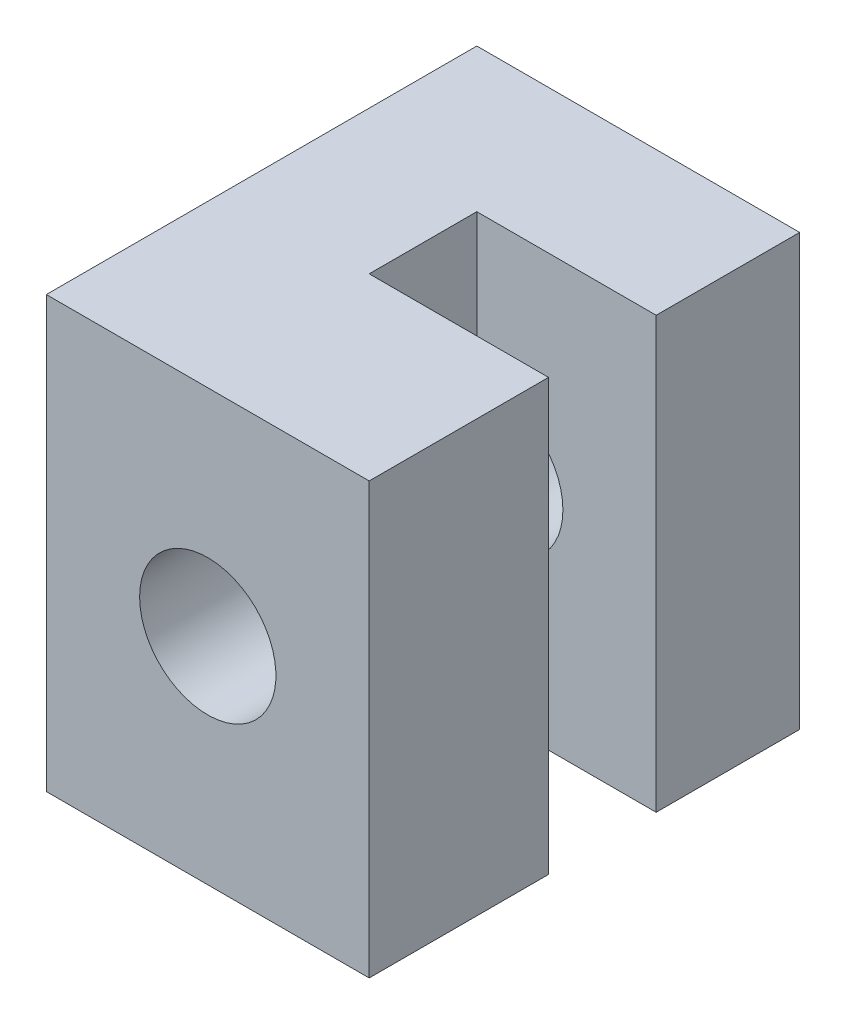
ISO-10303-21;
HEADER;
FILE_DESCRIPTION(('STEP AP214'),'2;1');
FILE_NAME('part.step','',(''),(''),'','','');
FILE_SCHEMA(('AUTOMOTIVE_DESIGN { 1 0 10303 214 1 1 1 1 }'));
ENDSEC;
DATA;
#1=APPLICATION_CONTEXT('core data for automotive mechanical design processes');
#2=APPLICATION_PROTOCOL_DEFINITION('international standard','automotive_design',2000,#1);
#3=PRODUCT_CONTEXT('',#1,'mechanical');
#4=PRODUCT('Part','Part','',(#3));
#5=PRODUCT_RELATED_PRODUCT_CATEGORY('part','',(#4));
#6=PRODUCT_DEFINITION_FORMATION('','',#4);
#7=PRODUCT_DEFINITION_CONTEXT('part definition',#1,'design');
#8=PRODUCT_DEFINITION('design','',#6,#7);
#9=PRODUCT_DEFINITION_SHAPE('','',#8);
#10=(LENGTH_UNIT() NAMED_UNIT(*) SI_UNIT(.MILLI.,.METRE.));
#11=(NAMED_UNIT(*) PLANE_ANGLE_UNIT() SI_UNIT($,.RADIAN.));
#12=(NAMED_UNIT(*) SI_UNIT($,.STERADIAN.) SOLID_ANGLE_UNIT());
#13=UNCERTAINTY_MEASURE_WITH_UNIT(LENGTH_MEASURE(1.E-05),#10,'distance_accuracy_value','');
#14=(GEOMETRIC_REPRESENTATION_CONTEXT(3) GLOBAL_UNCERTAINTY_ASSIGNED_CONTEXT((#13)) GLOBAL_UNIT_ASSIGNED_CONTEXT((#10,
#11,#12)) REPRESENTATION_CONTEXT('',''));
#15=CARTESIAN_POINT('',(0.,0.,0.));
#16=DIRECTION('',(0.,0.,1.));
#17=DIRECTION('',(1.,0.,0.));
#18=AXIS2_PLACEMENT_3D('',#15,#16,#17);
#19=CARTESIAN_POINT('',(-0.500000000000002,6.,0.));
#20=DIRECTION('',(-1.,0.,0.));
#21=DIRECTION('',(0.,0.,1.));
#22=AXIS2_PLACEMENT_3D('',#19,#20,#21);
#23=PLANE('',#22);
#24=DIRECTION('',(0.,-1.,0.));
#25=VECTOR('',#24,1.);
#26=CARTESIAN_POINT('',(-0.500000000000002,6.,1.));
#27=LINE('',#26,#25);
#28=CARTESIAN_POINT('',(-0.500000000000002,6.,1.));
#29=VERTEX_POINT('',#28);
#30=CARTESIAN_POINT('',(-0.500000000000002,1.83303027798233,1.));
#31=VERTEX_POINT('',#30);
#32=EDGE_CURVE('E170',#29,#31,#27,.T.);
#33=ORIENTED_EDGE('',*,*,#32,.T.);
#34=DIRECTION('',(0.,0.,-1.));
#35=VECTOR('',#34,1.);
#36=CARTESIAN_POINT('',(-0.500000000000002,1.83303027798233,6.));
#37=LINE('',#36,#35);
#38=CARTESIAN_POINT('',(-0.500000000000002,1.83303027798233,-2.));
#39=VERTEX_POINT('',#38);
#40=EDGE_CURVE('E56',#31,#39,#37,.T.);
#41=ORIENTED_EDGE('',*,*,#40,.T.);
#42=DIRECTION('',(0.,-1.,0.));
#43=VECTOR('',#42,1.);
#44=CARTESIAN_POINT('',(-0.500000000000002,6.,-2.));
#45=LINE('',#44,#43);
#46=CARTESIAN_POINT('',(-0.500000000000002,6.,-2.));
#47=VERTEX_POINT('',#46);
#48=EDGE_CURVE('E49',#47,#39,#45,.T.);
#49=ORIENTED_EDGE('',*,*,#48,.F.);
#50=DIRECTION('',(0.,0.,-1.));
#51=VECTOR('',#50,1.);
#52=CARTESIAN_POINT('',(-0.500000000000002,6.,0.));
#53=LINE('',#52,#51);
#54=EDGE_CURVE('E169',#29,#47,#53,.T.);
#55=ORIENTED_EDGE('',*,*,#54,.F.);
#56=EDGE_LOOP('',(#33,#41,#49,#55));
#57=FACE_BOUND('',#56,.T.);
#58=ADVANCED_FACE('F41',(#57),#23,.F.);
#59=CARTESIAN_POINT('',(-0.500000000000002,-1.83303027798234,-2.));
#60=VERTEX_POINT('',#59);
#61=CARTESIAN_POINT('',(-0.500000000000002,-6.,-2.));
#62=VERTEX_POINT('',#61);
#63=EDGE_CURVE('E181',#60,#62,#45,.T.);
#64=ORIENTED_EDGE('',*,*,#63,.F.);
#65=DIRECTION('',(0.,0.,-1.));
#66=VECTOR('',#65,1.);
#67=CARTESIAN_POINT('',(-0.500000000000002,-1.83303027798234,6.));
#68=LINE('',#67,#66);
#69=CARTESIAN_POINT('',(-0.500000000000002,-1.83303027798234,1.));
#70=VERTEX_POINT('',#69);
#71=EDGE_CURVE('E208',#60,#70,#68,.F.);
#72=ORIENTED_EDGE('',*,*,#71,.T.);
#73=CARTESIAN_POINT('',(-0.500000000000002,-6.,1.));
#74=VERTEX_POINT('',#73);
#75=EDGE_CURVE('E98',#70,#74,#27,.T.);
#76=ORIENTED_EDGE('',*,*,#75,.T.);
#77=DIRECTION('',(0.,0.,-1.));
#78=VECTOR('',#77,1.);
#79=CARTESIAN_POINT('',(-0.500000000000002,-6.,0.));
#80=LINE('',#79,#78);
#81=EDGE_CURVE('E150',#74,#62,#80,.T.);
#82=ORIENTED_EDGE('',*,*,#81,.T.);
#83=EDGE_LOOP('',(#64,#72,#76,#82));
#84=FACE_BOUND('',#83,.T.);
#85=ADVANCED_FACE('F43',(#84),#23,.F.);
#86=CARTESIAN_POINT('',(0.,6.,-2.));
#87=DIRECTION('',(0.,0.,-1.));
#88=DIRECTION('',(-1.,0.,0.));
#89=AXIS2_PLACEMENT_3D('',#86,#87,#88);
#90=PLANE('',#89);
#91=ORIENTED_EDGE('',*,*,#48,.T.);
#92=CARTESIAN_POINT('',(0.,0.,-2.));
#93=DIRECTION('',(0.,0.,-1.));
#94=DIRECTION('',(-1.,0.,0.));
#95=AXIS2_PLACEMENT_3D('',#92,#93,#94);
#96=CIRCLE('',#95,1.9);
#97=EDGE_CURVE('E153',#39,#60,#96,.T.);
#98=ORIENTED_EDGE('',*,*,#97,.T.);
#99=ORIENTED_EDGE('',*,*,#63,.T.);
#100=DIRECTION('',(1.,0.,0.));
#101=VECTOR('',#100,1.);
#102=CARTESIAN_POINT('',(0.,-6.,-2.));
#103=LINE('',#102,#101);
#104=CARTESIAN_POINT('',(4.5,-6.,-2.));
#105=VERTEX_POINT('',#104);
#106=EDGE_CURVE('E152',#62,#105,#103,.T.);
#107=ORIENTED_EDGE('',*,*,#106,.T.);
#108=DIRECTION('',(0.,-1.,0.));
#109=VECTOR('',#108,1.);
#110=CARTESIAN_POINT('',(4.5,6.,-2.));
#111=LINE('',#110,#109);
#112=CARTESIAN_POINT('',(4.5,6.,-2.));
#113=VERTEX_POINT('',#112);
#114=EDGE_CURVE('E179',#113,#105,#111,.T.);
#115=ORIENTED_EDGE('',*,*,#114,.F.);
#116=DIRECTION('',(1.,0.,0.));
#117=VECTOR('',#116,1.);
#118=CARTESIAN_POINT('',(0.,6.,-2.));
#119=LINE('',#118,#117);
#120=EDGE_CURVE('E107',#47,#113,#119,.T.);
#121=ORIENTED_EDGE('',*,*,#120,.F.);
#122=EDGE_LOOP('',(#91,#98,#99,#107,#115,#121));
#123=FACE_BOUND('',#122,.T.);
#124=ADVANCED_FACE('F186',(#123),#90,.F.);
#125=CARTESIAN_POINT('',(4.5,6.,0.));
#126=DIRECTION('',(-1.,0.,0.));
#127=DIRECTION('',(0.,0.,1.));
#128=AXIS2_PLACEMENT_3D('',#125,#126,#127);
#129=PLANE('',#128);
#130=DIRECTION('',(0.,0.,-1.));
#131=VECTOR('',#130,1.);
#132=CARTESIAN_POINT('',(4.5,-6.,0.));
#133=LINE('',#132,#131);
#134=CARTESIAN_POINT('',(4.5,-6.,-6.));
#135=VERTEX_POINT('',#134);
#136=EDGE_CURVE('E155',#105,#135,#133,.T.);
#137=ORIENTED_EDGE('',*,*,#136,.T.);
#138=DIRECTION('',(0.,-1.,0.));
#139=VECTOR('',#138,1.);
#140=CARTESIAN_POINT('',(4.5,6.,-6.));
#141=LINE('',#140,#139);
#142=CARTESIAN_POINT('',(4.5,6.,-6.));
#143=VERTEX_POINT('',#142);
#144=EDGE_CURVE('E177',#143,#135,#141,.T.);
#145=ORIENTED_EDGE('',*,*,#144,.F.);
#146=DIRECTION('',(0.,0.,-1.));
#147=VECTOR('',#146,1.);
#148=CARTESIAN_POINT('',(4.5,6.,0.));
#149=LINE('',#148,#147);
#150=EDGE_CURVE('E221',#113,#143,#149,.T.);
#151=ORIENTED_EDGE('',*,*,#150,.F.);
#152=ORIENTED_EDGE('',*,*,#114,.T.);
#153=EDGE_LOOP('',(#137,#145,#151,#152));
#154=FACE_BOUND('',#153,.T.);
#155=ADVANCED_FACE('F198',(#154),#129,.F.);
#156=CARTESIAN_POINT('',(0.,6.,-6.));
#157=DIRECTION('',(0.,0.,-1.));
#158=DIRECTION('',(-1.,0.,0.));
#159=AXIS2_PLACEMENT_3D('',#156,#157,#158);
#160=PLANE('',#159);
#161=CARTESIAN_POINT('',(0.,0.,-6.));
#162=DIRECTION('',(0.,0.,-1.));
#163=DIRECTION('',(-1.,0.,0.));
#164=AXIS2_PLACEMENT_3D('',#161,#162,#163);
#165=CIRCLE('',#164,1.9);
#166=CARTESIAN_POINT('',(-1.9,0.,-6.));
#167=VERTEX_POINT('',#166);
#168=EDGE_CURVE('E214',#167,#167,#165,.T.);
#169=ORIENTED_EDGE('',*,*,#168,.F.);
#170=EDGE_LOOP('',(#169));
#171=FACE_BOUND('',#170,.T.);
#172=DIRECTION('',(1.,0.,0.));
#173=VECTOR('',#172,1.);
#174=CARTESIAN_POINT('',(0.,-6.,-6.));
#175=LINE('',#174,#173);
#176=CARTESIAN_POINT('',(-4.5,-6.,-6.));
#177=VERTEX_POINT('',#176);
#178=EDGE_CURVE('E158',#177,#135,#175,.T.);
#179=ORIENTED_EDGE('',*,*,#178,.F.);
#180=DIRECTION('',(0.,-1.,0.));
#181=VECTOR('',#180,1.);
#182=CARTESIAN_POINT('',(-4.5,6.,-6.));
#183=LINE('',#182,#181);
#184=CARTESIAN_POINT('',(-4.5,6.,-6.));
#185=VERTEX_POINT('',#184);
#186=EDGE_CURVE('E175',#185,#177,#183,.T.);
#187=ORIENTED_EDGE('',*,*,#186,.F.);
#188=DIRECTION('',(1.,0.,0.));
#189=VECTOR('',#188,1.);
#190=CARTESIAN_POINT('',(0.,6.,-6.));
#191=LINE('',#190,#189);
#192=EDGE_CURVE('E223',#185,#143,#191,.T.);
#193=ORIENTED_EDGE('',*,*,#192,.T.);
#194=ORIENTED_EDGE('',*,*,#144,.T.);
#195=EDGE_LOOP('',(#179,#187,#193,#194));
#196=FACE_BOUND('',#195,.T.);
#197=ADVANCED_FACE('F230',(#171,#196),#160,.T.);
#198=CARTESIAN_POINT('',(-4.5,6.,0.));
#199=DIRECTION('',(-1.,0.,0.));
#200=DIRECTION('',(0.,0.,1.));
#201=AXIS2_PLACEMENT_3D('',#198,#199,#200);
#202=PLANE('',#201);
#203=DIRECTION('',(0.,0.,-1.));
#204=VECTOR('',#203,1.);
#205=CARTESIAN_POINT('',(-4.5,-6.,0.));
#206=LINE('',#205,#204);
#207=CARTESIAN_POINT('',(-4.5,-6.,6.));
#208=VERTEX_POINT('',#207);
#209=EDGE_CURVE('E161',#208,#177,#206,.T.);
#210=ORIENTED_EDGE('',*,*,#209,.F.);
#211=DIRECTION('',(0.,-1.,0.));
#212=VECTOR('',#211,1.);
#213=CARTESIAN_POINT('',(-4.5,6.,6.));
#214=LINE('',#213,#212);
#215=CARTESIAN_POINT('',(-4.5,6.,6.));
#216=VERTEX_POINT('',#215);
#217=EDGE_CURVE('E141',#216,#208,#214,.T.);
#218=ORIENTED_EDGE('',*,*,#217,.F.);
#219=DIRECTION('',(0.,0.,-1.));
#220=VECTOR('',#219,1.);
#221=CARTESIAN_POINT('',(-4.5,6.,0.));
#222=LINE('',#221,#220);
#223=EDGE_CURVE('E131',#216,#185,#222,.T.);
#224=ORIENTED_EDGE('',*,*,#223,.T.);
#225=ORIENTED_EDGE('',*,*,#186,.T.);
#226=EDGE_LOOP('',(#210,#218,#224,#225));
#227=FACE_BOUND('',#226,.T.);
#228=ADVANCED_FACE('F227',(#227),#202,.T.);
#229=CARTESIAN_POINT('',(0.,6.,6.));
#230=DIRECTION('',(0.,0.,-1.));
#231=DIRECTION('',(-1.,0.,0.));
#232=AXIS2_PLACEMENT_3D('',#229,#230,#231);
#233=PLANE('',#232);
#234=CARTESIAN_POINT('',(0.,0.,6.));
#235=DIRECTION('',(0.,0.,-1.));
#236=DIRECTION('',(-1.,0.,0.));
#237=AXIS2_PLACEMENT_3D('',#234,#235,#236);
#238=CIRCLE('',#237,1.9);
#239=CARTESIAN_POINT('',(-1.9,0.,6.));
#240=VERTEX_POINT('',#239);
#241=EDGE_CURVE('E210',#240,#240,#238,.T.);
#242=ORIENTED_EDGE('',*,*,#241,.T.);
#243=EDGE_LOOP('',(#242));
#244=FACE_BOUND('',#243,.T.);
#245=DIRECTION('',(1.,0.,0.));
#246=VECTOR('',#245,1.);
#247=CARTESIAN_POINT('',(0.,-6.,6.));
#248=LINE('',#247,#246);
#249=CARTESIAN_POINT('',(4.5,-6.,6.));
#250=VERTEX_POINT('',#249);
#251=EDGE_CURVE('E138',#208,#250,#248,.T.);
#252=ORIENTED_EDGE('',*,*,#251,.T.);
#253=DIRECTION('',(0.,-1.,0.));
#254=VECTOR('',#253,1.);
#255=CARTESIAN_POINT('',(4.5,6.,6.));
#256=LINE('',#255,#254);
#257=CARTESIAN_POINT('',(4.5,6.,6.));
#258=VERTEX_POINT('',#257);
#259=EDGE_CURVE('E135',#258,#250,#256,.T.);
#260=ORIENTED_EDGE('',*,*,#259,.F.);
#261=DIRECTION('',(1.,0.,0.));
#262=VECTOR('',#261,1.);
#263=CARTESIAN_POINT('',(0.,6.,6.));
#264=LINE('',#263,#262);
#265=EDGE_CURVE('E123',#216,#258,#264,.T.);
#266=ORIENTED_EDGE('',*,*,#265,.F.);
#267=ORIENTED_EDGE('',*,*,#217,.T.);
#268=EDGE_LOOP('',(#252,#260,#266,#267));
#269=FACE_BOUND('',#268,.T.);
#270=ADVANCED_FACE('F136',(#244,#269),#233,.F.);
#271=CARTESIAN_POINT('',(4.5,6.,0.));
#272=DIRECTION('',(-1.,0.,0.));
#273=DIRECTION('',(0.,0.,1.));
#274=AXIS2_PLACEMENT_3D('',#271,#272,#273);
#275=PLANE('',#274);
#276=DIRECTION('',(0.,0.,-1.));
#277=VECTOR('',#276,1.);
#278=CARTESIAN_POINT('',(4.5,-6.,0.));
#279=LINE('',#278,#277);
#280=CARTESIAN_POINT('',(4.5,-6.,1.));
#281=VERTEX_POINT('',#280);
#282=EDGE_CURVE('E165',#250,#281,#279,.T.);
#283=ORIENTED_EDGE('',*,*,#282,.T.);
#284=DIRECTION('',(0.,-1.,0.));
#285=VECTOR('',#284,1.);
#286=CARTESIAN_POINT('',(4.5,6.,1.));
#287=LINE('',#286,#285);
#288=CARTESIAN_POINT('',(4.5,6.,1.));
#289=VERTEX_POINT('',#288);
#290=EDGE_CURVE('E142',#289,#281,#287,.T.);
#291=ORIENTED_EDGE('',*,*,#290,.F.);
#292=DIRECTION('',(0.,0.,-1.));
#293=VECTOR('',#292,1.);
#294=CARTESIAN_POINT('',(4.5,6.,0.));
#295=LINE('',#294,#293);
#296=EDGE_CURVE('E127',#258,#289,#295,.T.);
#297=ORIENTED_EDGE('',*,*,#296,.F.);
#298=ORIENTED_EDGE('',*,*,#259,.T.);
#299=EDGE_LOOP('',(#283,#291,#297,#298));
#300=FACE_BOUND('',#299,.T.);
#301=ADVANCED_FACE('F144',(#300),#275,.F.);
#302=CARTESIAN_POINT('',(0.,6.,1.));
#303=DIRECTION('',(0.,0.,1.));
#304=DIRECTION('',(1.,0.,0.));
#305=AXIS2_PLACEMENT_3D('',#302,#303,#304);
#306=PLANE('',#305);
#307=ORIENTED_EDGE('',*,*,#75,.F.);
#308=CARTESIAN_POINT('',(0.,0.,1.));
#309=DIRECTION('',(0.,0.,1.));
#310=DIRECTION('',(1.,0.,0.));
#311=AXIS2_PLACEMENT_3D('',#308,#309,#310);
#312=CIRCLE('',#311,1.9);
#313=EDGE_CURVE('E11',#70,#31,#312,.T.);
#314=ORIENTED_EDGE('',*,*,#313,.T.);
#315=ORIENTED_EDGE('',*,*,#32,.F.);
#316=DIRECTION('',(-1.,0.,0.));
#317=VECTOR('',#316,1.);
#318=CARTESIAN_POINT('',(0.,6.,1.));
#319=LINE('',#318,#317);
#320=EDGE_CURVE('E64',#289,#29,#319,.T.);
#321=ORIENTED_EDGE('',*,*,#320,.F.);
#322=ORIENTED_EDGE('',*,*,#290,.T.);
#323=DIRECTION('',(-1.,0.,0.));
#324=VECTOR('',#323,1.);
#325=CARTESIAN_POINT('',(0.,-6.,1.));
#326=LINE('',#325,#324);
#327=EDGE_CURVE('E167',#281,#74,#326,.T.);
#328=ORIENTED_EDGE('',*,*,#327,.T.);
#329=EDGE_LOOP('',(#307,#314,#315,#321,#322,#328));
#330=FACE_BOUND('',#329,.T.);
#331=ADVANCED_FACE('F204',(#330),#306,.F.);
#332=CARTESIAN_POINT('',(0.,6.,0.));
#333=DIRECTION('',(0.,1.,0.));
#334=DIRECTION('',(0.,0.,1.));
#335=AXIS2_PLACEMENT_3D('',#332,#333,#334);
#336=PLANE('',#335);
#337=ORIENTED_EDGE('',*,*,#54,.T.);
#338=ORIENTED_EDGE('',*,*,#120,.T.);
#339=ORIENTED_EDGE('',*,*,#150,.T.);
#340=ORIENTED_EDGE('',*,*,#192,.F.);
#341=ORIENTED_EDGE('',*,*,#223,.F.);
#342=ORIENTED_EDGE('',*,*,#265,.T.);
#343=ORIENTED_EDGE('',*,*,#296,.T.);
#344=ORIENTED_EDGE('',*,*,#320,.T.);
#345=EDGE_LOOP('',(#337,#338,#339,#340,#341,#342,#343,#344));
#346=FACE_BOUND('',#345,.T.);
#347=ADVANCED_FACE('F125',(#346),#336,.T.);
#348=CARTESIAN_POINT('',(0.,-6.,0.));
#349=DIRECTION('',(0.,1.,0.));
#350=DIRECTION('',(0.,0.,1.));
#351=AXIS2_PLACEMENT_3D('',#348,#349,#350);
#352=PLANE('',#351);
#353=ORIENTED_EDGE('',*,*,#81,.F.);
#354=ORIENTED_EDGE('',*,*,#327,.F.);
#355=ORIENTED_EDGE('',*,*,#282,.F.);
#356=ORIENTED_EDGE('',*,*,#251,.F.);
#357=ORIENTED_EDGE('',*,*,#209,.T.);
#358=ORIENTED_EDGE('',*,*,#178,.T.);
#359=ORIENTED_EDGE('',*,*,#136,.F.);
#360=ORIENTED_EDGE('',*,*,#106,.F.);
#361=EDGE_LOOP('',(#353,#354,#355,#356,#357,#358,#359,#360));
#362=FACE_BOUND('',#361,.T.);
#363=ADVANCED_FACE('F191',(#362),#352,.F.);
#364=CARTESIAN_POINT('',(0.,0.,6.));
#365=DIRECTION('',(0.,0.,-1.));
#366=DIRECTION('',(-1.,0.,0.));
#367=AXIS2_PLACEMENT_3D('',#364,#365,#366);
#368=CYLINDRICAL_SURFACE('',#367,1.9);
#369=ORIENTED_EDGE('',*,*,#241,.F.);
#370=EDGE_LOOP('',(#369));
#371=FACE_BOUND('',#370,.T.);
#372=ORIENTED_EDGE('',*,*,#168,.T.);
#373=EDGE_LOOP('',(#372));
#374=FACE_BOUND('',#373,.T.);
#375=ORIENTED_EDGE('',*,*,#40,.F.);
#376=ORIENTED_EDGE('',*,*,#313,.F.);
#377=ORIENTED_EDGE('',*,*,#71,.F.);
#378=ORIENTED_EDGE('',*,*,#97,.F.);
#379=EDGE_LOOP('',(#375,#376,#377,#378));
#380=FACE_BOUND('',#379,.T.);
#381=ADVANCED_FACE('F207',(#371,#374,#380),#368,.F.);
#382=CLOSED_SHELL('',(#58,#85,#124,#155,#197,#228,#270,#301,#331,#347,#363,#381));
#383=MANIFOLD_SOLID_BREP('B2',#382);
#384=ADVANCED_BREP_SHAPE_REPRESENTATION('',(#18,#383),#14);
#385=SHAPE_DEFINITION_REPRESENTATION(#9,#384);
ENDSEC;
END-ISO-10303-21;
